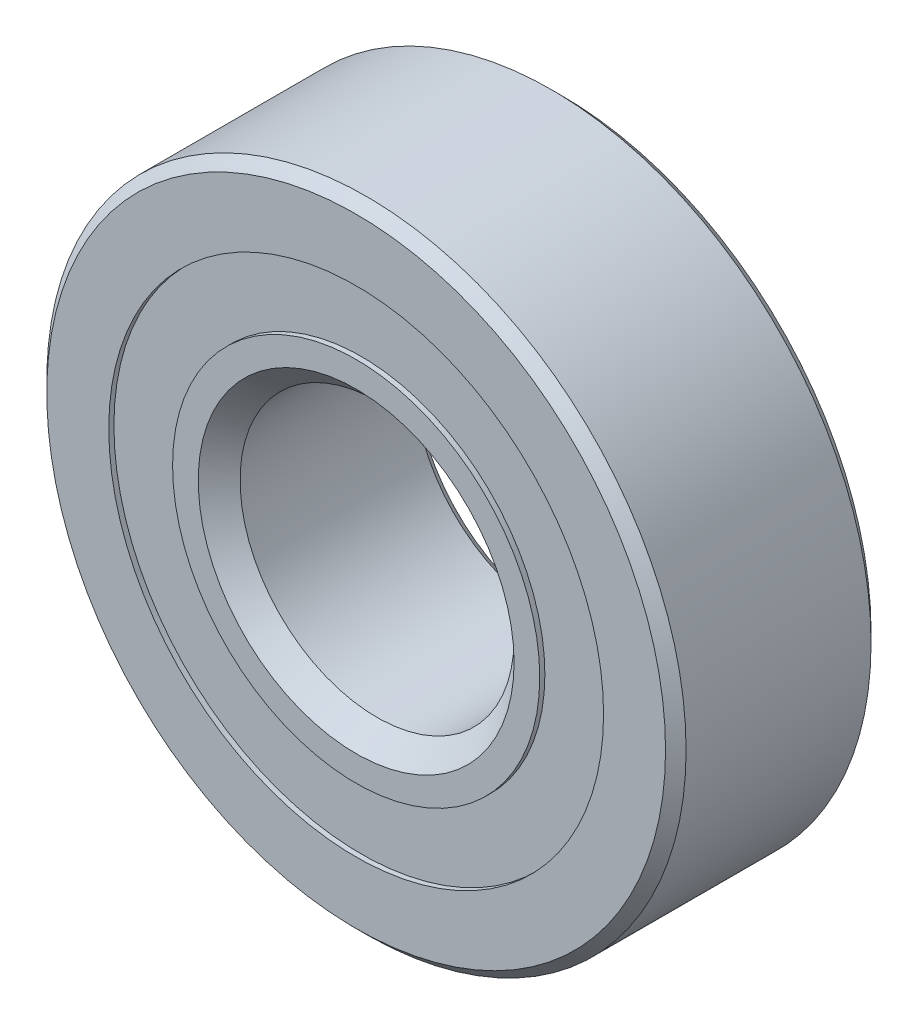
ISO-10303-21;
HEADER;
FILE_DESCRIPTION(('STEP AP214'),'2;1');
FILE_NAME('part.step','',(''),(''),'','','');
FILE_SCHEMA(('AUTOMOTIVE_DESIGN { 1 0 10303 214 1 1 1 1 }'));
ENDSEC;
DATA;
#1=APPLICATION_CONTEXT('core data for automotive mechanical design processes');
#2=APPLICATION_PROTOCOL_DEFINITION('international standard','automotive_design',2000,#1);
#3=PRODUCT_CONTEXT('',#1,'mechanical');
#4=PRODUCT('Part','Part','',(#3));
#5=PRODUCT_RELATED_PRODUCT_CATEGORY('part','',(#4));
#6=PRODUCT_DEFINITION_FORMATION('','',#4);
#7=PRODUCT_DEFINITION_CONTEXT('part definition',#1,'design');
#8=PRODUCT_DEFINITION('design','',#6,#7);
#9=PRODUCT_DEFINITION_SHAPE('','',#8);
#10=(LENGTH_UNIT() NAMED_UNIT(*) SI_UNIT(.MILLI.,.METRE.));
#11=(NAMED_UNIT(*) PLANE_ANGLE_UNIT() SI_UNIT($,.RADIAN.));
#12=(NAMED_UNIT(*) SI_UNIT($,.STERADIAN.) SOLID_ANGLE_UNIT());
#13=UNCERTAINTY_MEASURE_WITH_UNIT(LENGTH_MEASURE(1.E-05),#10,'distance_accuracy_value','');
#14=(GEOMETRIC_REPRESENTATION_CONTEXT(3) GLOBAL_UNCERTAINTY_ASSIGNED_CONTEXT((#13)) GLOBAL_UNIT_ASSIGNED_CONTEXT((#10,
#11,#12)) REPRESENTATION_CONTEXT('',''));
#15=CARTESIAN_POINT('',(0.,0.,0.));
#16=DIRECTION('',(0.,0.,1.));
#17=DIRECTION('',(1.,0.,0.));
#18=AXIS2_PLACEMENT_3D('',#15,#16,#17);
#19=CARTESIAN_POINT('',(0.,8.60041208791209,-3.39328125));
#20=DIRECTION('',(0.,0.,1.));
#21=DIRECTION('',(1.,0.,0.));
#22=AXIS2_PLACEMENT_3D('',#19,#20,#21);
#23=PLANE('',#22);
#24=CARTESIAN_POINT('',(0.,0.,-3.39328125));
#25=DIRECTION('',(0.,0.,1.));
#26=DIRECTION('',(1.,0.,0.));
#27=AXIS2_PLACEMENT_3D('',#24,#25,#26);
#28=CIRCLE('',#27,8.60041208791209);
#29=CARTESIAN_POINT('',(8.60041208791209,0.,-3.39328125));
#30=VERTEX_POINT('',#29);
#31=EDGE_CURVE('E57',#30,#30,#28,.T.);
#32=ORIENTED_EDGE('',*,*,#31,.F.);
#33=EDGE_LOOP('',(#32));
#34=FACE_BOUND('',#33,.T.);
#35=CARTESIAN_POINT('',(0.,0.,-3.39328125));
#36=DIRECTION('',(0.,0.,1.));
#37=DIRECTION('',(1.,0.,0.));
#38=AXIS2_PLACEMENT_3D('',#35,#36,#37);
#39=CIRCLE('',#38,6.38220612444005);
#40=CARTESIAN_POINT('',(6.38220612444005,0.,-3.39328125));
#41=VERTEX_POINT('',#40);
#42=EDGE_CURVE('E11',#41,#41,#39,.T.);
#43=ORIENTED_EDGE('',*,*,#42,.T.);
#44=EDGE_LOOP('',(#43));
#45=FACE_BOUND('',#44,.T.);
#46=ADVANCED_FACE('F43',(#34,#45),#23,.F.);
#47=CARTESIAN_POINT('',(0.,0.,3.571875));
#48=DIRECTION('',(0.,0.,1.));
#49=DIRECTION('',(1.,0.,0.));
#50=AXIS2_PLACEMENT_3D('',#47,#48,#49);
#51=CYLINDRICAL_SURFACE('',#50,6.38220612444005);
#52=ORIENTED_EDGE('',*,*,#42,.F.);
#53=EDGE_LOOP('',(#52));
#54=FACE_BOUND('',#53,.T.);
#55=CARTESIAN_POINT('',(0.,0.,-1.72035132641562));
#56=DIRECTION('',(0.,0.,1.));
#57=DIRECTION('',(1.,0.,0.));
#58=AXIS2_PLACEMENT_3D('',#55,#56,#57);
#59=CIRCLE('',#58,6.38220612444005);
#60=CARTESIAN_POINT('',(6.38220612444005,0.,-1.72035132641562));
#61=VERTEX_POINT('',#60);
#62=EDGE_CURVE('E49',#61,#61,#59,.T.);
#63=ORIENTED_EDGE('',*,*,#62,.T.);
#64=EDGE_LOOP('',(#63));
#65=FACE_BOUND('',#64,.T.);
#66=ADVANCED_FACE('F66',(#54,#65),#51,.F.);
#67=CARTESIAN_POINT('',(0.,8.60041208791209,-1.72035132641562));
#68=DIRECTION('',(0.,0.,-1.));
#69=DIRECTION('',(-1.,0.,0.));
#70=AXIS2_PLACEMENT_3D('',#67,#68,#69);
#71=PLANE('',#70);
#72=ORIENTED_EDGE('',*,*,#62,.F.);
#73=EDGE_LOOP('',(#72));
#74=FACE_BOUND('',#73,.T.);
#75=CARTESIAN_POINT('',(0.,0.,-1.72035132641562));
#76=DIRECTION('',(0.,0.,1.));
#77=DIRECTION('',(1.,0.,0.));
#78=AXIS2_PLACEMENT_3D('',#75,#76,#77);
#79=CIRCLE('',#78,8.60041208791209);
#80=CARTESIAN_POINT('',(8.60041208791209,0.,-1.72035132641562));
#81=VERTEX_POINT('',#80);
#82=EDGE_CURVE('E53',#81,#81,#79,.T.);
#83=ORIENTED_EDGE('',*,*,#82,.T.);
#84=EDGE_LOOP('',(#83));
#85=FACE_BOUND('',#84,.T.);
#86=ADVANCED_FACE('F70',(#74,#85),#71,.F.);
#87=CARTESIAN_POINT('',(0.,0.,3.571875));
#88=DIRECTION('',(0.,0.,1.));
#89=DIRECTION('',(1.,0.,0.));
#90=AXIS2_PLACEMENT_3D('',#87,#88,#89);
#91=CYLINDRICAL_SURFACE('',#90,8.60041208791209);
#92=ORIENTED_EDGE('',*,*,#82,.F.);
#93=EDGE_LOOP('',(#92));
#94=FACE_BOUND('',#93,.T.);
#95=ORIENTED_EDGE('',*,*,#31,.T.);
#96=EDGE_LOOP('',(#95));
#97=FACE_BOUND('',#96,.T.);
#98=ADVANCED_FACE('F63',(#94,#97),#91,.T.);
#99=CLOSED_SHELL('',(#46,#66,#86,#98));
#100=MANIFOLD_SOLID_BREP('B2',#99);
#101=CARTESIAN_POINT('',(0.,8.60041208791209,3.39328125));
#102=DIRECTION('',(0.,0.,-1.));
#103=DIRECTION('',(-1.,0.,0.));
#104=AXIS2_PLACEMENT_3D('',#101,#102,#103);
#105=PLANE('',#104);
#106=CARTESIAN_POINT('',(0.,0.,3.39328125));
#107=DIRECTION('',(0.,0.,1.));
#108=DIRECTION('',(1.,0.,0.));
#109=AXIS2_PLACEMENT_3D('',#106,#107,#108);
#110=CIRCLE('',#109,6.38220612444005);
#111=CARTESIAN_POINT('',(6.38220612444005,0.,3.39328125));
#112=VERTEX_POINT('',#111);
#113=EDGE_CURVE('E42',#112,#112,#110,.T.);
#114=ORIENTED_EDGE('',*,*,#113,.F.);
#115=EDGE_LOOP('',(#114));
#116=FACE_BOUND('',#115,.T.);
#117=CARTESIAN_POINT('',(0.,0.,3.39328125));
#118=DIRECTION('',(0.,0.,1.));
#119=DIRECTION('',(1.,0.,0.));
#120=AXIS2_PLACEMENT_3D('',#117,#118,#119);
#121=CIRCLE('',#120,8.60041208791209);
#122=CARTESIAN_POINT('',(8.60041208791209,0.,3.39328125));
#123=VERTEX_POINT('',#122);
#124=EDGE_CURVE('E124',#123,#123,#121,.T.);
#125=ORIENTED_EDGE('',*,*,#124,.T.);
#126=EDGE_LOOP('',(#125));
#127=FACE_BOUND('',#126,.T.);
#128=ADVANCED_FACE('F110',(#116,#127),#105,.F.);
#129=CARTESIAN_POINT('',(0.,0.,3.571875));
#130=DIRECTION('',(0.,0.,1.));
#131=DIRECTION('',(1.,0.,0.));
#132=AXIS2_PLACEMENT_3D('',#129,#130,#131);
#133=CYLINDRICAL_SURFACE('',#132,6.38220612444005);
#134=CARTESIAN_POINT('',(0.,0.,1.72035132641561));
#135=DIRECTION('',(0.,0.,1.));
#136=DIRECTION('',(1.,0.,0.));
#137=AXIS2_PLACEMENT_3D('',#134,#135,#136);
#138=CIRCLE('',#137,6.38220612444005);
#139=CARTESIAN_POINT('',(6.38220612444005,0.,1.72035132641561));
#140=VERTEX_POINT('',#139);
#141=EDGE_CURVE('E116',#140,#140,#138,.T.);
#142=ORIENTED_EDGE('',*,*,#141,.F.);
#143=EDGE_LOOP('',(#142));
#144=FACE_BOUND('',#143,.T.);
#145=ORIENTED_EDGE('',*,*,#113,.T.);
#146=EDGE_LOOP('',(#145));
#147=FACE_BOUND('',#146,.T.);
#148=ADVANCED_FACE('F139',(#144,#147),#133,.F.);
#149=CARTESIAN_POINT('',(0.,8.60041208791209,1.72035132641561));
#150=DIRECTION('',(0.,0.,1.));
#151=DIRECTION('',(1.,0.,0.));
#152=AXIS2_PLACEMENT_3D('',#149,#150,#151);
#153=PLANE('',#152);
#154=CARTESIAN_POINT('',(0.,0.,1.72035132641561));
#155=DIRECTION('',(0.,0.,1.));
#156=DIRECTION('',(1.,0.,0.));
#157=AXIS2_PLACEMENT_3D('',#154,#155,#156);
#158=CIRCLE('',#157,8.60041208791209);
#159=CARTESIAN_POINT('',(8.60041208791209,0.,1.72035132641561));
#160=VERTEX_POINT('',#159);
#161=EDGE_CURVE('E120',#160,#160,#158,.T.);
#162=ORIENTED_EDGE('',*,*,#161,.F.);
#163=EDGE_LOOP('',(#162));
#164=FACE_BOUND('',#163,.T.);
#165=ORIENTED_EDGE('',*,*,#141,.T.);
#166=EDGE_LOOP('',(#165));
#167=FACE_BOUND('',#166,.T.);
#168=ADVANCED_FACE('F134',(#164,#167),#153,.F.);
#169=CARTESIAN_POINT('',(0.,0.,3.571875));
#170=DIRECTION('',(0.,0.,1.));
#171=DIRECTION('',(1.,0.,0.));
#172=AXIS2_PLACEMENT_3D('',#169,#170,#171);
#173=CYLINDRICAL_SURFACE('',#172,8.60041208791209);
#174=ORIENTED_EDGE('',*,*,#124,.F.);
#175=EDGE_LOOP('',(#174));
#176=FACE_BOUND('',#175,.T.);
#177=ORIENTED_EDGE('',*,*,#161,.T.);
#178=EDGE_LOOP('',(#177));
#179=FACE_BOUND('',#178,.T.);
#180=ADVANCED_FACE('F131',(#176,#179),#173,.T.);
#181=CLOSED_SHELL('',(#128,#148,#168,#180));
#182=MANIFOLD_SOLID_BREP('B6',#181);
#183=CARTESIAN_POINT('',(-3.96874999999991,6.87407664253903,0.));
#184=DIRECTION('',(0.,0.,1.));
#185=DIRECTION('',(-0.499999999999989,0.866025403784445,0.));
#186=AXIS2_PLACEMENT_3D('',#183,#184,#185);
#187=SPHERICAL_SURFACE('',#186,1.72035132641561);
#188=CARTESIAN_POINT('',(-3.96874999999991,6.87407664253903,1.72035132641561));
#189=VERTEX_POINT('',#188);
#190=VERTEX_LOOP('',#189);
#191=FACE_BOUND('',#190,.T.);
#192=ADVANCED_FACE('F192',(#191),#187,.T.);
#193=CLOSED_SHELL('',(#192));
#194=MANIFOLD_SOLID_BREP('B37',#193);
#195=CARTESIAN_POINT('',(-6.87407664253894,3.96875000000008,0.));
#196=DIRECTION('',(0.,0.,1.));
#197=DIRECTION('',(-0.866025403784433,0.50000000000001,0.));
#198=AXIS2_PLACEMENT_3D('',#195,#196,#197);
#199=SPHERICAL_SURFACE('',#198,1.72035132641561);
#200=CARTESIAN_POINT('',(-6.87407664253894,3.96875000000008,1.72035132641561));
#201=VERTEX_POINT('',#200);
#202=VERTEX_LOOP('',#201);
#203=FACE_BOUND('',#202,.T.);
#204=ADVANCED_FACE('F225',(#203),#199,.T.);
#205=CLOSED_SHELL('',(#204));
#206=MANIFOLD_SOLID_BREP('B106',#205);
#207=CARTESIAN_POINT('',(-7.9375,0.,0.));
#208=DIRECTION('',(0.,0.,1.));
#209=DIRECTION('',(-1.,0.,0.));
#210=AXIS2_PLACEMENT_3D('',#207,#208,#209);
#211=SPHERICAL_SURFACE('',#210,1.72035132641561);
#212=CARTESIAN_POINT('',(-7.9375,0.,1.72035132641561));
#213=VERTEX_POINT('',#212);
#214=VERTEX_LOOP('',#213);
#215=FACE_BOUND('',#214,.T.);
#216=ADVANCED_FACE('F258',(#215),#211,.T.);
#217=CLOSED_SHELL('',(#216));
#218=MANIFOLD_SOLID_BREP('B188',#217);
#219=CARTESIAN_POINT('',(-6.87407664253902,-3.96874999999994,0.));
#220=DIRECTION('',(0.,0.,1.));
#221=DIRECTION('',(-0.866025403784443,-0.499999999999992,0.));
#222=AXIS2_PLACEMENT_3D('',#219,#220,#221);
#223=SPHERICAL_SURFACE('',#222,1.72035132641561);
#224=CARTESIAN_POINT('',(-6.87407664253902,-3.96874999999994,1.72035132641561));
#225=VERTEX_POINT('',#224);
#226=VERTEX_LOOP('',#225);
#227=FACE_BOUND('',#226,.T.);
#228=ADVANCED_FACE('F291',(#227),#223,.T.);
#229=CLOSED_SHELL('',(#228));
#230=MANIFOLD_SOLID_BREP('B221',#229);
#231=CARTESIAN_POINT('',(-3.96875000000006,-6.87407664253895,0.));
#232=DIRECTION('',(0.,0.,1.));
#233=DIRECTION('',(-0.500000000000007,-0.866025403784435,0.));
#234=AXIS2_PLACEMENT_3D('',#231,#232,#233);
#235=SPHERICAL_SURFACE('',#234,1.72035132641561);
#236=CARTESIAN_POINT('',(-3.96875000000006,-6.87407664253895,1.72035132641561));
#237=VERTEX_POINT('',#236);
#238=VERTEX_LOOP('',#237);
#239=FACE_BOUND('',#238,.T.);
#240=ADVANCED_FACE('F324',(#239),#235,.T.);
#241=CLOSED_SHELL('',(#240));
#242=MANIFOLD_SOLID_BREP('B254',#241);
#243=CARTESIAN_POINT('',(0.,-7.9375,0.));
#244=DIRECTION('',(0.,0.,1.));
#245=DIRECTION('',(0.,-1.,0.));
#246=AXIS2_PLACEMENT_3D('',#243,#244,#245);
#247=SPHERICAL_SURFACE('',#246,1.72035132641561);
#248=CARTESIAN_POINT('',(0.,-7.9375,1.72035132641561));
#249=VERTEX_POINT('',#248);
#250=VERTEX_LOOP('',#249);
#251=FACE_BOUND('',#250,.T.);
#252=ADVANCED_FACE('F357',(#251),#247,.T.);
#253=CLOSED_SHELL('',(#252));
#254=MANIFOLD_SOLID_BREP('B287',#253);
#255=CARTESIAN_POINT('',(3.96874999999996,-6.87407664253901,0.));
#256=DIRECTION('',(0.,0.,1.));
#257=DIRECTION('',(0.499999999999995,-0.866025403784442,0.));
#258=AXIS2_PLACEMENT_3D('',#255,#256,#257);
#259=SPHERICAL_SURFACE('',#258,1.72035132641561);
#260=CARTESIAN_POINT('',(3.96874999999996,-6.87407664253901,1.72035132641561));
#261=VERTEX_POINT('',#260);
#262=VERTEX_LOOP('',#261);
#263=FACE_BOUND('',#262,.T.);
#264=ADVANCED_FACE('F390',(#263),#259,.T.);
#265=CLOSED_SHELL('',(#264));
#266=MANIFOLD_SOLID_BREP('B320',#265);
#267=CARTESIAN_POINT('',(6.87407664253896,-3.96875000000003,0.));
#268=DIRECTION('',(0.,0.,1.));
#269=DIRECTION('',(0.866025403784436,-0.500000000000004,0.));
#270=AXIS2_PLACEMENT_3D('',#267,#268,#269);
#271=SPHERICAL_SURFACE('',#270,1.72035132641561);
#272=CARTESIAN_POINT('',(6.87407664253896,-3.96875000000003,1.72035132641561));
#273=VERTEX_POINT('',#272);
#274=VERTEX_LOOP('',#273);
#275=FACE_BOUND('',#274,.T.);
#276=ADVANCED_FACE('F423',(#275),#271,.T.);
#277=CLOSED_SHELL('',(#276));
#278=MANIFOLD_SOLID_BREP('B353',#277);
#279=CARTESIAN_POINT('',(7.9375,0.,0.));
#280=DIRECTION('',(0.,0.,1.));
#281=DIRECTION('',(1.,0.,0.));
#282=AXIS2_PLACEMENT_3D('',#279,#280,#281);
#283=SPHERICAL_SURFACE('',#282,1.72035132641561);
#284=CARTESIAN_POINT('',(7.9375,0.,1.72035132641561));
#285=VERTEX_POINT('',#284);
#286=VERTEX_LOOP('',#285);
#287=FACE_BOUND('',#286,.T.);
#288=ADVANCED_FACE('F456',(#287),#283,.T.);
#289=CLOSED_SHELL('',(#288));
#290=MANIFOLD_SOLID_BREP('B386',#289);
#291=CARTESIAN_POINT('',(6.87407664253899,3.96874999999998,0.));
#292=DIRECTION('',(0.,0.,1.));
#293=DIRECTION('',(0.86602540378444,0.499999999999998,0.));
#294=AXIS2_PLACEMENT_3D('',#291,#292,#293);
#295=SPHERICAL_SURFACE('',#294,1.72035132641561);
#296=CARTESIAN_POINT('',(6.87407664253899,3.96874999999998,1.72035132641561));
#297=VERTEX_POINT('',#296);
#298=VERTEX_LOOP('',#297);
#299=FACE_BOUND('',#298,.T.);
#300=ADVANCED_FACE('F489',(#299),#295,.T.);
#301=CLOSED_SHELL('',(#300));
#302=MANIFOLD_SOLID_BREP('B419',#301);
#303=CARTESIAN_POINT('',(3.96875000000001,6.87407664253898,0.));
#304=DIRECTION('',(0.,0.,1.));
#305=DIRECTION('',(0.500000000000001,0.866025403784438,0.));
#306=AXIS2_PLACEMENT_3D('',#303,#304,#305);
#307=SPHERICAL_SURFACE('',#306,1.72035132641561);
#308=CARTESIAN_POINT('',(3.96875000000001,6.87407664253898,1.72035132641561));
#309=VERTEX_POINT('',#308);
#310=VERTEX_LOOP('',#309);
#311=FACE_BOUND('',#310,.T.);
#312=ADVANCED_FACE('F522',(#311),#307,.T.);
#313=CLOSED_SHELL('',(#312));
#314=MANIFOLD_SOLID_BREP('B452',#313);
#315=CARTESIAN_POINT('',(0.,7.9375,0.));
#316=DIRECTION('',(0.,0.,1.));
#317=DIRECTION('',(0.,1.,0.));
#318=AXIS2_PLACEMENT_3D('',#315,#316,#317);
#319=SPHERICAL_SURFACE('',#318,1.72035132641561);
#320=CARTESIAN_POINT('',(0.,7.9375,1.72035132641561));
#321=VERTEX_POINT('',#320);
#322=VERTEX_LOOP('',#321);
#323=FACE_BOUND('',#322,.T.);
#324=ADVANCED_FACE('F557',(#323),#319,.T.);
#325=CLOSED_SHELL('',(#324));
#326=MANIFOLD_SOLID_BREP('B485',#325);
#327=CARTESIAN_POINT('',(0.,0.,3.571875));
#328=DIRECTION('',(0.,0.,1.));
#329=DIRECTION('',(1.,0.,0.));
#330=AXIS2_PLACEMENT_3D('',#327,#328,#329);
#331=CYLINDRICAL_SURFACE('',#330,6.38220612444005);
#332=CARTESIAN_POINT('',(0.,0.,3.571875));
#333=DIRECTION('',(0.,0.,1.));
#334=DIRECTION('',(1.,0.,0.));
#335=AXIS2_PLACEMENT_3D('',#332,#333,#334);
#336=CIRCLE('',#335,6.38220612444005);
#337=CARTESIAN_POINT('',(6.38220612444005,0.,3.571875));
#338=VERTEX_POINT('',#337);
#339=EDGE_CURVE('E616',#338,#338,#336,.T.);
#340=ORIENTED_EDGE('',*,*,#339,.F.);
#341=EDGE_LOOP('',(#340));
#342=FACE_BOUND('',#341,.T.);
#343=CARTESIAN_POINT('',(0.,0.,3.39328125));
#344=DIRECTION('',(0.,0.,1.));
#345=DIRECTION('',(1.,0.,0.));
#346=AXIS2_PLACEMENT_3D('',#343,#344,#345);
#347=CIRCLE('',#346,6.38220612444005);
#348=CARTESIAN_POINT('',(6.38220612444005,0.,3.39328125));
#349=VERTEX_POINT('',#348);
#350=EDGE_CURVE('E556',#349,#349,#347,.T.);
#351=ORIENTED_EDGE('',*,*,#350,.T.);
#352=EDGE_LOOP('',(#351));
#353=FACE_BOUND('',#352,.T.);
#354=ADVANCED_FACE('F576',(#342,#353),#331,.T.);
#355=CARTESIAN_POINT('',(0.,6.38220612444005,3.39328125));
#356=DIRECTION('',(0.,0.,1.));
#357=DIRECTION('',(1.,0.,0.));
#358=AXIS2_PLACEMENT_3D('',#355,#356,#357);
#359=PLANE('',#358);
#360=ORIENTED_EDGE('',*,*,#350,.F.);
#361=EDGE_LOOP('',(#360));
#362=FACE_BOUND('',#361,.T.);
#363=CARTESIAN_POINT('',(0.,0.,3.39328125));
#364=DIRECTION('',(0.,0.,1.));
#365=DIRECTION('',(1.,0.,0.));
#366=AXIS2_PLACEMENT_3D('',#363,#364,#365);
#367=CIRCLE('',#366,6.20361237444005);
#368=CARTESIAN_POINT('',(6.20361237444005,0.,3.39328125));
#369=VERTEX_POINT('',#368);
#370=EDGE_CURVE('E582',#369,#369,#367,.T.);
#371=ORIENTED_EDGE('',*,*,#370,.T.);
#372=EDGE_LOOP('',(#371));
#373=FACE_BOUND('',#372,.T.);
#374=ADVANCED_FACE('F623',(#362,#373),#359,.F.);
#375=CARTESIAN_POINT('',(0.,0.,2.67949321235215));
#376=DIRECTION('',(0.,0.,1.));
#377=DIRECTION('',(1.,0.,0.));
#378=AXIS2_PLACEMENT_3D('',#375,#376,#377);
#379=CONICAL_SURFACE('',#378,5.48982433679219,0.78539816339745);
#380=ORIENTED_EDGE('',*,*,#370,.F.);
#381=EDGE_LOOP('',(#380));
#382=FACE_BOUND('',#381,.T.);
#383=CARTESIAN_POINT('',(0.,0.,2.67949321235215));
#384=DIRECTION('',(0.,0.,1.));
#385=DIRECTION('',(1.,0.,0.));
#386=AXIS2_PLACEMENT_3D('',#383,#384,#385);
#387=CIRCLE('',#386,5.48982433679219);
#388=CARTESIAN_POINT('',(5.48982433679219,0.,2.67949321235215));
#389=VERTEX_POINT('',#388);
#390=EDGE_CURVE('E586',#389,#389,#387,.T.);
#391=ORIENTED_EDGE('',*,*,#390,.T.);
#392=EDGE_LOOP('',(#391));
#393=FACE_BOUND('',#392,.T.);
#394=ADVANCED_FACE('F627',(#382,#393),#379,.T.);
#395=CARTESIAN_POINT('',(0.,0.,3.571875));
#396=DIRECTION('',(0.,0.,1.));
#397=DIRECTION('',(1.,0.,0.));
#398=AXIS2_PLACEMENT_3D('',#395,#396,#397);
#399=CYLINDRICAL_SURFACE('',#398,5.48982433679219);
#400=ORIENTED_EDGE('',*,*,#390,.F.);
#401=EDGE_LOOP('',(#400));
#402=FACE_BOUND('',#401,.T.);
#403=CARTESIAN_POINT('',(0.,0.,0.));
#404=DIRECTION('',(0.,0.,1.));
#405=DIRECTION('',(1.,0.,0.));
#406=AXIS2_PLACEMENT_3D('',#403,#404,#405);
#407=CIRCLE('',#406,5.48982433679219);
#408=CARTESIAN_POINT('',(5.48982433679219,0.,0.));
#409=VERTEX_POINT('',#408);
#410=EDGE_CURVE('E590',#409,#409,#407,.T.);
#411=ORIENTED_EDGE('',*,*,#410,.T.);
#412=EDGE_LOOP('',(#411));
#413=FACE_BOUND('',#412,.T.);
#414=ADVANCED_FACE('F632',(#402,#413),#399,.T.);
#415=CARTESIAN_POINT('',(0.,5.48982433679219,0.));
#416=DIRECTION('',(0.,0.,-1.));
#417=DIRECTION('',(-1.,0.,0.));
#418=AXIS2_PLACEMENT_3D('',#415,#416,#417);
#419=PLANE('',#418);
#420=ORIENTED_EDGE('',*,*,#410,.F.);
#421=EDGE_LOOP('',(#420));
#422=FACE_BOUND('',#421,.T.);
#423=CARTESIAN_POINT('',(0.,0.,0.));
#424=DIRECTION('',(0.,0.,1.));
#425=DIRECTION('',(1.,0.,0.));
#426=AXIS2_PLACEMENT_3D('',#423,#424,#425);
#427=CIRCLE('',#426,6.21714867358439);
#428=CARTESIAN_POINT('',(6.21714867358439,0.,0.));
#429=VERTEX_POINT('',#428);
#430=EDGE_CURVE('E595',#429,#429,#427,.T.);
#431=ORIENTED_EDGE('',*,*,#430,.T.);
#432=EDGE_LOOP('',(#431));
#433=FACE_BOUND('',#432,.T.);
#434=ADVANCED_FACE('F638',(#422,#433),#419,.F.);
#435=CARTESIAN_POINT('',(0.,0.,0.));
#436=DIRECTION('',(0.,0.,1.));
#437=DIRECTION('',(1.,0.,0.));
#438=AXIS2_PLACEMENT_3D('',#435,#436,#437);
#439=TOROIDAL_SURFACE('',#438,7.9375,1.72035132641561);
#440=ORIENTED_EDGE('',*,*,#430,.F.);
#441=EDGE_LOOP('',(#440));
#442=FACE_BOUND('',#441,.T.);
#443=CARTESIAN_POINT('',(0.,0.,-1.5875));
#444=DIRECTION('',(0.,0.,1.));
#445=DIRECTION('',(1.,0.,0.));
#446=AXIS2_PLACEMENT_3D('',#443,#444,#445);
#447=CIRCLE('',#446,7.27458791208791);
#448=CARTESIAN_POINT('',(7.27458791208791,0.,-1.5875));
#449=VERTEX_POINT('',#448);
#450=EDGE_CURVE('E598',#449,#449,#447,.T.);
#451=ORIENTED_EDGE('',*,*,#450,.T.);
#452=EDGE_LOOP('',(#451));
#453=FACE_BOUND('',#452,.T.);
#454=ADVANCED_FACE('F642',(#442,#453),#439,.F.);
#455=CARTESIAN_POINT('',(0.,0.,3.571875));
#456=DIRECTION('',(0.,0.,1.));
#457=DIRECTION('',(1.,0.,0.));
#458=AXIS2_PLACEMENT_3D('',#455,#456,#457);
#459=CYLINDRICAL_SURFACE('',#458,7.27458791208791);
#460=ORIENTED_EDGE('',*,*,#450,.F.);
#461=EDGE_LOOP('',(#460));
#462=FACE_BOUND('',#461,.T.);
#463=CARTESIAN_POINT('',(0.,0.,-3.571875));
#464=DIRECTION('',(0.,0.,1.));
#465=DIRECTION('',(1.,0.,0.));
#466=AXIS2_PLACEMENT_3D('',#463,#464,#465);
#467=CIRCLE('',#466,7.27458791208791);
#468=CARTESIAN_POINT('',(7.27458791208791,0.,-3.571875));
#469=VERTEX_POINT('',#468);
#470=EDGE_CURVE('E601',#469,#469,#467,.T.);
#471=ORIENTED_EDGE('',*,*,#470,.T.);
#472=EDGE_LOOP('',(#471));
#473=FACE_BOUND('',#472,.T.);
#474=ADVANCED_FACE('F646',(#462,#473),#459,.T.);
#475=CARTESIAN_POINT('',(0.,5.1196875,-3.571875));
#476=DIRECTION('',(0.,0.,1.));
#477=DIRECTION('',(1.,0.,0.));
#478=AXIS2_PLACEMENT_3D('',#475,#476,#477);
#479=PLANE('',#478);
#480=ORIENTED_EDGE('',*,*,#470,.F.);
#481=EDGE_LOOP('',(#480));
#482=FACE_BOUND('',#481,.T.);
#483=CARTESIAN_POINT('',(0.,0.,-3.571875));
#484=DIRECTION('',(0.,0.,1.));
#485=DIRECTION('',(1.,0.,0.));
#486=AXIS2_PLACEMENT_3D('',#483,#484,#485);
#487=CIRCLE('',#486,5.1196875);
#488=CARTESIAN_POINT('',(5.1196875,0.,-3.571875));
#489=VERTEX_POINT('',#488);
#490=EDGE_CURVE('E604',#489,#489,#487,.T.);
#491=ORIENTED_EDGE('',*,*,#490,.T.);
#492=EDGE_LOOP('',(#491));
#493=FACE_BOUND('',#492,.T.);
#494=ADVANCED_FACE('F650',(#482,#493),#479,.F.);
#495=CARTESIAN_POINT('',(0.,0.,-3.2146875));
#496=DIRECTION('',(0.,0.,-1.));
#497=DIRECTION('',(-1.,0.,0.));
#498=AXIS2_PLACEMENT_3D('',#495,#496,#497);
#499=CONICAL_SURFACE('',#498,4.7625,0.785398163397448);
#500=ORIENTED_EDGE('',*,*,#490,.F.);
#501=EDGE_LOOP('',(#500));
#502=FACE_BOUND('',#501,.T.);
#503=CARTESIAN_POINT('',(0.,0.,-3.2146875));
#504=DIRECTION('',(0.,0.,1.));
#505=DIRECTION('',(1.,0.,0.));
#506=AXIS2_PLACEMENT_3D('',#503,#504,#505);
#507=CIRCLE('',#506,4.7625);
#508=CARTESIAN_POINT('',(4.7625,0.,-3.2146875));
#509=VERTEX_POINT('',#508);
#510=EDGE_CURVE('E607',#509,#509,#507,.T.);
#511=ORIENTED_EDGE('',*,*,#510,.T.);
#512=EDGE_LOOP('',(#511));
#513=FACE_BOUND('',#512,.T.);
#514=ADVANCED_FACE('F654',(#502,#513),#499,.F.);
#515=CARTESIAN_POINT('',(0.,0.,3.571875));
#516=DIRECTION('',(0.,0.,1.));
#517=DIRECTION('',(1.,0.,0.));
#518=AXIS2_PLACEMENT_3D('',#515,#516,#517);
#519=CYLINDRICAL_SURFACE('',#518,4.7625);
#520=ORIENTED_EDGE('',*,*,#510,.F.);
#521=EDGE_LOOP('',(#520));
#522=FACE_BOUND('',#521,.T.);
#523=CARTESIAN_POINT('',(0.,0.,2.84455066320781));
#524=DIRECTION('',(0.,0.,1.));
#525=DIRECTION('',(1.,0.,0.));
#526=AXIS2_PLACEMENT_3D('',#523,#524,#525);
#527=CIRCLE('',#526,4.7625);
#528=CARTESIAN_POINT('',(4.7625,0.,2.84455066320781));
#529=VERTEX_POINT('',#528);
#530=EDGE_CURVE('E610',#529,#529,#527,.T.);
#531=ORIENTED_EDGE('',*,*,#530,.T.);
#532=EDGE_LOOP('',(#531));
#533=FACE_BOUND('',#532,.T.);
#534=ADVANCED_FACE('F658',(#522,#533),#519,.F.);
#535=CARTESIAN_POINT('',(0.,0.,3.571875));
#536=DIRECTION('',(0.,0.,1.));
#537=DIRECTION('',(1.,0.,0.));
#538=AXIS2_PLACEMENT_3D('',#535,#536,#537);
#539=CONICAL_SURFACE('',#538,5.48982433679219,0.78539816339745);
#540=ORIENTED_EDGE('',*,*,#530,.F.);
#541=EDGE_LOOP('',(#540));
#542=FACE_BOUND('',#541,.T.);
#543=CARTESIAN_POINT('',(0.,0.,3.571875));
#544=DIRECTION('',(0.,0.,1.));
#545=DIRECTION('',(1.,0.,0.));
#546=AXIS2_PLACEMENT_3D('',#543,#544,#545);
#547=CIRCLE('',#546,5.48982433679219);
#548=CARTESIAN_POINT('',(5.48982433679219,0.,3.571875));
#549=VERTEX_POINT('',#548);
#550=EDGE_CURVE('E613',#549,#549,#547,.T.);
#551=ORIENTED_EDGE('',*,*,#550,.T.);
#552=EDGE_LOOP('',(#551));
#553=FACE_BOUND('',#552,.T.);
#554=ADVANCED_FACE('F662',(#542,#553),#539,.F.);
#555=CARTESIAN_POINT('',(0.,6.38220612444005,3.571875));
#556=DIRECTION('',(0.,0.,-1.));
#557=DIRECTION('',(-1.,0.,0.));
#558=AXIS2_PLACEMENT_3D('',#555,#556,#557);
#559=PLANE('',#558);
#560=ORIENTED_EDGE('',*,*,#550,.F.);
#561=EDGE_LOOP('',(#560));
#562=FACE_BOUND('',#561,.T.);
#563=ORIENTED_EDGE('',*,*,#339,.T.);
#564=EDGE_LOOP('',(#563));
#565=FACE_BOUND('',#564,.T.);
#566=ADVANCED_FACE('F620',(#562,#565),#559,.F.);
#567=CLOSED_SHELL('',(#354,#374,#394,#414,#434,#454,#474,#494,#514,#534,#554,#566));
#568=MANIFOLD_SOLID_BREP('B518',#567);
#569=CARTESIAN_POINT('',(0.,0.,3.2146875));
#570=DIRECTION('',(0.,0.,-1.));
#571=DIRECTION('',(-1.,0.,0.));
#572=AXIS2_PLACEMENT_3D('',#569,#570,#571);
#573=CONICAL_SURFACE('',#572,11.1125,0.785398163397446);
#574=CARTESIAN_POINT('',(0.,0.,3.571875));
#575=DIRECTION('',(0.,0.,1.));
#576=DIRECTION('',(1.,0.,0.));
#577=AXIS2_PLACEMENT_3D('',#574,#575,#576);
#578=CIRCLE('',#577,10.7553125);
#579=CARTESIAN_POINT('',(10.7553125,0.,3.571875));
#580=VERTEX_POINT('',#579);
#581=EDGE_CURVE('E785',#580,#580,#578,.T.);
#582=ORIENTED_EDGE('',*,*,#581,.F.);
#583=EDGE_LOOP('',(#582));
#584=FACE_BOUND('',#583,.T.);
#585=CARTESIAN_POINT('',(0.,0.,3.2146875));
#586=DIRECTION('',(0.,0.,1.));
#587=DIRECTION('',(1.,0.,0.));
#588=AXIS2_PLACEMENT_3D('',#585,#586,#587);
#589=CIRCLE('',#588,11.1125);
#590=CARTESIAN_POINT('',(11.1125,0.,3.2146875));
#591=VERTEX_POINT('',#590);
#592=EDGE_CURVE('E575',#591,#591,#589,.T.);
#593=ORIENTED_EDGE('',*,*,#592,.T.);
#594=EDGE_LOOP('',(#593));
#595=FACE_BOUND('',#594,.T.);
#596=ADVANCED_FACE('F757',(#584,#595),#573,.T.);
#597=CARTESIAN_POINT('',(0.,0.,3.571875));
#598=DIRECTION('',(0.,0.,1.));
#599=DIRECTION('',(1.,0.,0.));
#600=AXIS2_PLACEMENT_3D('',#597,#598,#599);
#601=CYLINDRICAL_SURFACE('',#600,11.1125);
#602=ORIENTED_EDGE('',*,*,#592,.F.);
#603=EDGE_LOOP('',(#602));
#604=FACE_BOUND('',#603,.T.);
#605=CARTESIAN_POINT('',(0.,0.,-3.2146875));
#606=DIRECTION('',(0.,0.,1.));
#607=DIRECTION('',(1.,0.,0.));
#608=AXIS2_PLACEMENT_3D('',#605,#606,#607);
#609=CIRCLE('',#608,11.1125);
#610=CARTESIAN_POINT('',(11.1125,0.,-3.2146875));
#611=VERTEX_POINT('',#610);
#612=EDGE_CURVE('E763',#611,#611,#609,.T.);
#613=ORIENTED_EDGE('',*,*,#612,.T.);
#614=EDGE_LOOP('',(#613));
#615=FACE_BOUND('',#614,.T.);
#616=ADVANCED_FACE('F792',(#604,#615),#601,.T.);
#617=CARTESIAN_POINT('',(0.,0.,-3.571875));
#618=DIRECTION('',(0.,0.,1.));
#619=DIRECTION('',(1.,0.,0.));
#620=AXIS2_PLACEMENT_3D('',#617,#618,#619);
#621=CONICAL_SURFACE('',#620,10.7553125,0.785398163397444);
#622=ORIENTED_EDGE('',*,*,#612,.F.);
#623=EDGE_LOOP('',(#622));
#624=FACE_BOUND('',#623,.T.);
#625=CARTESIAN_POINT('',(0.,0.,-3.571875));
#626=DIRECTION('',(0.,0.,1.));
#627=DIRECTION('',(1.,0.,0.));
#628=AXIS2_PLACEMENT_3D('',#625,#626,#627);
#629=CIRCLE('',#628,10.7553125);
#630=CARTESIAN_POINT('',(10.7553125,0.,-3.571875));
#631=VERTEX_POINT('',#630);
#632=EDGE_CURVE('E767',#631,#631,#629,.T.);
#633=ORIENTED_EDGE('',*,*,#632,.T.);
#634=EDGE_LOOP('',(#633));
#635=FACE_BOUND('',#634,.T.);
#636=ADVANCED_FACE('F796',(#624,#635),#621,.T.);
#637=CARTESIAN_POINT('',(0.,10.7553125,-3.571875));
#638=DIRECTION('',(0.,0.,1.));
#639=DIRECTION('',(1.,0.,0.));
#640=AXIS2_PLACEMENT_3D('',#637,#638,#639);
#641=PLANE('',#640);
#642=ORIENTED_EDGE('',*,*,#632,.F.);
#643=EDGE_LOOP('',(#642));
#644=FACE_BOUND('',#643,.T.);
#645=CARTESIAN_POINT('',(0.,0.,-3.571875));
#646=DIRECTION('',(0.,0.,1.));
#647=DIRECTION('',(1.,0.,0.));
#648=AXIS2_PLACEMENT_3D('',#645,#646,#647);
#649=CIRCLE('',#648,8.60041208791209);
#650=CARTESIAN_POINT('',(8.60041208791209,0.,-3.571875));
#651=VERTEX_POINT('',#650);
#652=EDGE_CURVE('E771',#651,#651,#649,.T.);
#653=ORIENTED_EDGE('',*,*,#652,.T.);
#654=EDGE_LOOP('',(#653));
#655=FACE_BOUND('',#654,.T.);
#656=ADVANCED_FACE('F801',(#644,#655),#641,.F.);
#657=CARTESIAN_POINT('',(0.,0.,3.571875));
#658=DIRECTION('',(0.,0.,1.));
#659=DIRECTION('',(1.,0.,0.));
#660=AXIS2_PLACEMENT_3D('',#657,#658,#659);
#661=CYLINDRICAL_SURFACE('',#660,8.60041208791209);
#662=ORIENTED_EDGE('',*,*,#652,.F.);
#663=EDGE_LOOP('',(#662));
#664=FACE_BOUND('',#663,.T.);
#665=CARTESIAN_POINT('',(0.,0.,-1.5875));
#666=DIRECTION('',(0.,0.,1.));
#667=DIRECTION('',(1.,0.,0.));
#668=AXIS2_PLACEMENT_3D('',#665,#666,#667);
#669=CIRCLE('',#668,8.60041208791209);
#670=CARTESIAN_POINT('',(8.60041208791209,0.,-1.5875));
#671=VERTEX_POINT('',#670);
#672=EDGE_CURVE('E776',#671,#671,#669,.T.);
#673=ORIENTED_EDGE('',*,*,#672,.T.);
#674=EDGE_LOOP('',(#673));
#675=FACE_BOUND('',#674,.T.);
#676=ADVANCED_FACE('F807',(#664,#675),#661,.F.);
#677=CARTESIAN_POINT('',(0.,0.,0.));
#678=DIRECTION('',(0.,0.,1.));
#679=DIRECTION('',(1.,0.,0.));
#680=AXIS2_PLACEMENT_3D('',#677,#678,#679);
#681=TOROIDAL_SURFACE('',#680,7.9375,1.72035132641561);
#682=ORIENTED_EDGE('',*,*,#672,.F.);
#683=EDGE_LOOP('',(#682));
#684=FACE_BOUND('',#683,.T.);
#685=CARTESIAN_POINT('',(0.,0.,1.5875));
#686=DIRECTION('',(0.,0.,1.));
#687=DIRECTION('',(1.,0.,0.));
#688=AXIS2_PLACEMENT_3D('',#685,#686,#687);
#689=CIRCLE('',#688,8.60041208791209);
#690=CARTESIAN_POINT('',(8.60041208791209,0.,1.5875));
#691=VERTEX_POINT('',#690);
#692=EDGE_CURVE('E779',#691,#691,#689,.T.);
#693=ORIENTED_EDGE('',*,*,#692,.T.);
#694=EDGE_LOOP('',(#693));
#695=FACE_BOUND('',#694,.T.);
#696=ADVANCED_FACE('F811',(#684,#695),#681,.F.);
#697=CARTESIAN_POINT('',(0.,0.,3.571875));
#698=DIRECTION('',(0.,0.,1.));
#699=DIRECTION('',(1.,0.,0.));
#700=AXIS2_PLACEMENT_3D('',#697,#698,#699);
#701=CYLINDRICAL_SURFACE('',#700,8.60041208791209);
#702=ORIENTED_EDGE('',*,*,#692,.F.);
#703=EDGE_LOOP('',(#702));
#704=FACE_BOUND('',#703,.T.);
#705=CARTESIAN_POINT('',(0.,0.,3.571875));
#706=DIRECTION('',(0.,0.,1.));
#707=DIRECTION('',(1.,0.,0.));
#708=AXIS2_PLACEMENT_3D('',#705,#706,#707);
#709=CIRCLE('',#708,8.60041208791209);
#710=CARTESIAN_POINT('',(8.60041208791209,0.,3.571875));
#711=VERTEX_POINT('',#710);
#712=EDGE_CURVE('E782',#711,#711,#709,.T.);
#713=ORIENTED_EDGE('',*,*,#712,.T.);
#714=EDGE_LOOP('',(#713));
#715=FACE_BOUND('',#714,.T.);
#716=ADVANCED_FACE('F815',(#704,#715),#701,.F.);
#717=CARTESIAN_POINT('',(0.,10.7553125,3.571875));
#718=DIRECTION('',(0.,0.,-1.));
#719=DIRECTION('',(-1.,0.,0.));
#720=AXIS2_PLACEMENT_3D('',#717,#718,#719);
#721=PLANE('',#720);
#722=ORIENTED_EDGE('',*,*,#712,.F.);
#723=EDGE_LOOP('',(#722));
#724=FACE_BOUND('',#723,.T.);
#725=ORIENTED_EDGE('',*,*,#581,.T.);
#726=EDGE_LOOP('',(#725));
#727=FACE_BOUND('',#726,.T.);
#728=ADVANCED_FACE('F789',(#724,#727),#721,.F.);
#729=CLOSED_SHELL('',(#596,#616,#636,#656,#676,#696,#716,#728));
#730=MANIFOLD_SOLID_BREP('B551',#729);
#731=ADVANCED_BREP_SHAPE_REPRESENTATION('',(#18,#100,#182,#194,#206,#218,#230,#242,#254,#266,
#278,#290,#302,#314,#326,#568,#730),#14);
#732=SHAPE_DEFINITION_REPRESENTATION(#9,#731);
ENDSEC;
END-ISO-10303-21;
